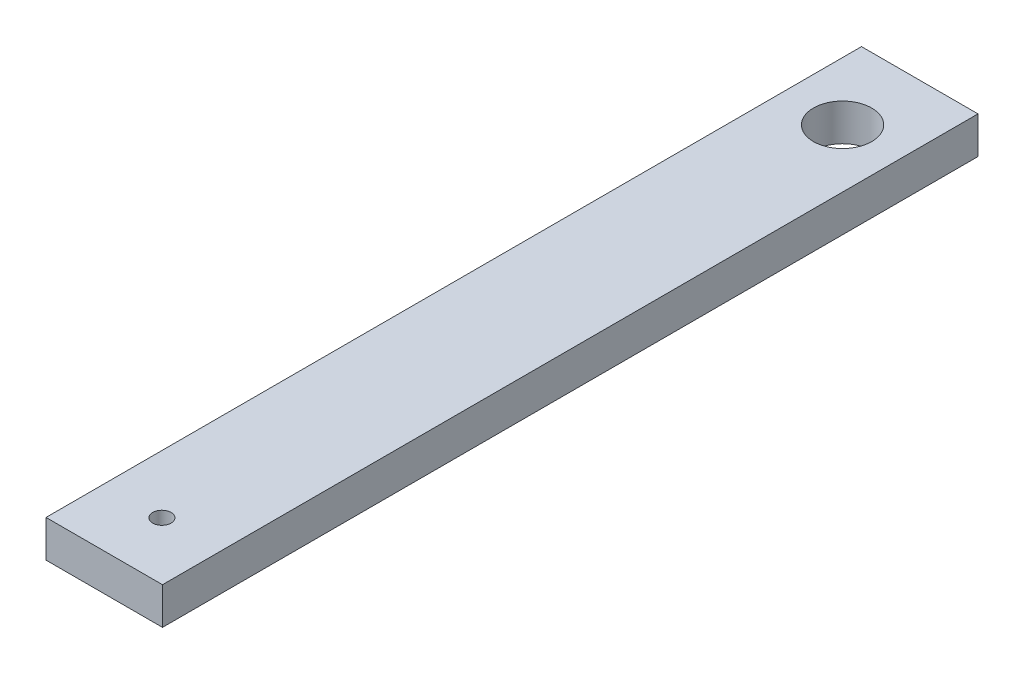
ISO-10303-21;
HEADER;
FILE_DESCRIPTION(('STEP AP214'),'2;1');
FILE_NAME('part.step','',(''),(''),'','','');
FILE_SCHEMA(('AUTOMOTIVE_DESIGN { 1 0 10303 214 1 1 1 1 }'));
ENDSEC;
DATA;
#1=APPLICATION_CONTEXT('core data for automotive mechanical design processes');
#2=APPLICATION_PROTOCOL_DEFINITION('international standard','automotive_design',2000,#1);
#3=PRODUCT_CONTEXT('',#1,'mechanical');
#4=PRODUCT('Part','Part','',(#3));
#5=PRODUCT_RELATED_PRODUCT_CATEGORY('part','',(#4));
#6=PRODUCT_DEFINITION_FORMATION('','',#4);
#7=PRODUCT_DEFINITION_CONTEXT('part definition',#1,'design');
#8=PRODUCT_DEFINITION('design','',#6,#7);
#9=PRODUCT_DEFINITION_SHAPE('','',#8);
#10=(LENGTH_UNIT() NAMED_UNIT(*) SI_UNIT(.MILLI.,.METRE.));
#11=(NAMED_UNIT(*) PLANE_ANGLE_UNIT() SI_UNIT($,.RADIAN.));
#12=(NAMED_UNIT(*) SI_UNIT($,.STERADIAN.) SOLID_ANGLE_UNIT());
#13=UNCERTAINTY_MEASURE_WITH_UNIT(LENGTH_MEASURE(1.E-05),#10,'distance_accuracy_value','');
#14=(GEOMETRIC_REPRESENTATION_CONTEXT(3) GLOBAL_UNCERTAINTY_ASSIGNED_CONTEXT((#13)) GLOBAL_UNIT_ASSIGNED_CONTEXT((#10,
#11,#12)) REPRESENTATION_CONTEXT('',''));
#15=CARTESIAN_POINT('',(0.,0.,0.));
#16=DIRECTION('',(0.,0.,1.));
#17=DIRECTION('',(1.,0.,0.));
#18=AXIS2_PLACEMENT_3D('',#15,#16,#17);
#19=CARTESIAN_POINT('',(0.,6.35,0.));
#20=DIRECTION('',(0.,-1.,0.));
#21=DIRECTION('',(0.,0.,-1.));
#22=AXIS2_PLACEMENT_3D('',#19,#20,#21);
#23=PLANE('',#22);
#24=DIRECTION('',(0.,0.,1.));
#25=VECTOR('',#24,1.);
#26=CARTESIAN_POINT('',(-9.99999999999999,6.35,63.375));
#27=LINE('',#26,#25);
#28=CARTESIAN_POINT('',(-10.,6.35,-76.625));
#29=VERTEX_POINT('',#28);
#30=CARTESIAN_POINT('',(-9.99999999999999,6.35,63.375));
#31=VERTEX_POINT('',#30);
#32=EDGE_CURVE('E96',#29,#31,#27,.T.);
#33=ORIENTED_EDGE('',*,*,#32,.T.);
#34=DIRECTION('',(1.,0.,0.));
#35=VECTOR('',#34,1.);
#36=CARTESIAN_POINT('',(-9.99999999999999,6.35,63.375));
#37=LINE('',#36,#35);
#38=CARTESIAN_POINT('',(9.99999999999999,6.35,63.375));
#39=VERTEX_POINT('',#38);
#40=EDGE_CURVE('E91',#31,#39,#37,.T.);
#41=ORIENTED_EDGE('',*,*,#40,.T.);
#42=DIRECTION('',(0.,0.,-1.));
#43=VECTOR('',#42,1.);
#44=CARTESIAN_POINT('',(9.99999999999999,6.35,63.375));
#45=LINE('',#44,#43);
#46=CARTESIAN_POINT('',(9.99999999999999,6.35,-76.625));
#47=VERTEX_POINT('',#46);
#48=EDGE_CURVE('E94',#39,#47,#45,.T.);
#49=ORIENTED_EDGE('',*,*,#48,.T.);
#50=DIRECTION('',(-1.,0.,0.));
#51=VECTOR('',#50,1.);
#52=CARTESIAN_POINT('',(-10.,6.35,-76.625));
#53=LINE('',#52,#51);
#54=EDGE_CURVE('E61',#47,#29,#53,.T.);
#55=ORIENTED_EDGE('',*,*,#54,.T.);
#56=EDGE_LOOP('',(#33,#41,#49,#55));
#57=FACE_BOUND('',#56,.T.);
#58=CARTESIAN_POINT('',(0.,6.35,-63.375));
#59=DIRECTION('',(0.,1.,0.));
#60=DIRECTION('',(0.,0.,1.));
#61=AXIS2_PLACEMENT_3D('',#58,#59,#60);
#62=CIRCLE('',#61,5.);
#63=CARTESIAN_POINT('',(0.,6.35,-58.375));
#64=VERTEX_POINT('',#63);
#65=EDGE_CURVE('E111',#64,#64,#62,.T.);
#66=ORIENTED_EDGE('',*,*,#65,.F.);
#67=EDGE_LOOP('',(#66));
#68=FACE_BOUND('',#67,.T.);
#69=CARTESIAN_POINT('',(0.,6.35,53.477664451473));
#70=DIRECTION('',(0.,1.,0.));
#71=DIRECTION('',(0.,0.,1.));
#72=AXIS2_PLACEMENT_3D('',#69,#70,#71);
#73=CIRCLE('',#72,1.5875);
#74=CARTESIAN_POINT('',(0.,6.35,55.065164451473));
#75=VERTEX_POINT('',#74);
#76=EDGE_CURVE('E126',#75,#75,#73,.T.);
#77=ORIENTED_EDGE('',*,*,#76,.F.);
#78=EDGE_LOOP('',(#77));
#79=FACE_BOUND('',#78,.T.);
#80=ADVANCED_FACE('F44',(#57,#68,#79),#23,.F.);
#81=CARTESIAN_POINT('',(0.,0.,0.));
#82=DIRECTION('',(0.,-1.,0.));
#83=DIRECTION('',(0.,0.,-1.));
#84=AXIS2_PLACEMENT_3D('',#81,#82,#83);
#85=PLANE('',#84);
#86=CARTESIAN_POINT('',(0.,0.,-63.375));
#87=DIRECTION('',(0.,1.,0.));
#88=DIRECTION('',(0.,0.,1.));
#89=AXIS2_PLACEMENT_3D('',#86,#87,#88);
#90=CIRCLE('',#89,5.);
#91=CARTESIAN_POINT('',(0.,0.,-58.375));
#92=VERTEX_POINT('',#91);
#93=EDGE_CURVE('E123',#92,#92,#90,.T.);
#94=ORIENTED_EDGE('',*,*,#93,.T.);
#95=EDGE_LOOP('',(#94));
#96=FACE_BOUND('',#95,.T.);
#97=DIRECTION('',(0.,0.,1.));
#98=VECTOR('',#97,1.);
#99=CARTESIAN_POINT('',(-9.99999999999999,0.,63.375));
#100=LINE('',#99,#98);
#101=CARTESIAN_POINT('',(-10.,0.,-76.625));
#102=VERTEX_POINT('',#101);
#103=CARTESIAN_POINT('',(-9.99999999999999,0.,63.375));
#104=VERTEX_POINT('',#103);
#105=EDGE_CURVE('E108',#102,#104,#100,.T.);
#106=ORIENTED_EDGE('',*,*,#105,.F.);
#107=DIRECTION('',(-1.,0.,0.));
#108=VECTOR('',#107,1.);
#109=CARTESIAN_POINT('',(-10.,0.,-76.625));
#110=LINE('',#109,#108);
#111=CARTESIAN_POINT('',(9.99999999999999,0.,-76.625));
#112=VERTEX_POINT('',#111);
#113=EDGE_CURVE('E84',#112,#102,#110,.T.);
#114=ORIENTED_EDGE('',*,*,#113,.F.);
#115=DIRECTION('',(0.,0.,-1.));
#116=VECTOR('',#115,1.);
#117=CARTESIAN_POINT('',(9.99999999999999,0.,63.375));
#118=LINE('',#117,#116);
#119=CARTESIAN_POINT('',(9.99999999999999,0.,63.375));
#120=VERTEX_POINT('',#119);
#121=EDGE_CURVE('E78',#120,#112,#118,.T.);
#122=ORIENTED_EDGE('',*,*,#121,.F.);
#123=DIRECTION('',(1.,0.,0.));
#124=VECTOR('',#123,1.);
#125=CARTESIAN_POINT('',(-9.99999999999999,0.,63.375));
#126=LINE('',#125,#124);
#127=EDGE_CURVE('E100',#104,#120,#126,.T.);
#128=ORIENTED_EDGE('',*,*,#127,.F.);
#129=EDGE_LOOP('',(#106,#114,#122,#128));
#130=FACE_BOUND('',#129,.T.);
#131=CARTESIAN_POINT('',(0.,0.,53.477664451473));
#132=DIRECTION('',(0.,1.,0.));
#133=DIRECTION('',(0.,0.,1.));
#134=AXIS2_PLACEMENT_3D('',#131,#132,#133);
#135=CIRCLE('',#134,1.5875);
#136=CARTESIAN_POINT('',(0.,0.,55.065164451473));
#137=VERTEX_POINT('',#136);
#138=EDGE_CURVE('E129',#137,#137,#135,.T.);
#139=ORIENTED_EDGE('',*,*,#138,.T.);
#140=EDGE_LOOP('',(#139));
#141=FACE_BOUND('',#140,.T.);
#142=ADVANCED_FACE('F119',(#96,#130,#141),#85,.T.);
#143=CARTESIAN_POINT('',(-9.99999999999999,6.35,63.375));
#144=DIRECTION('',(1.,0.,0.));
#145=DIRECTION('',(0.,0.,-1.));
#146=AXIS2_PLACEMENT_3D('',#143,#144,#145);
#147=PLANE('',#146);
#148=ORIENTED_EDGE('',*,*,#105,.T.);
#149=DIRECTION('',(0.,-1.,0.));
#150=VECTOR('',#149,1.);
#151=CARTESIAN_POINT('',(-9.99999999999999,6.35,63.375));
#152=LINE('',#151,#150);
#153=EDGE_CURVE('E13',#31,#104,#152,.T.);
#154=ORIENTED_EDGE('',*,*,#153,.F.);
#155=ORIENTED_EDGE('',*,*,#32,.F.);
#156=DIRECTION('',(0.,-1.,0.));
#157=VECTOR('',#156,1.);
#158=CARTESIAN_POINT('',(-10.,6.35,-76.625));
#159=LINE('',#158,#157);
#160=EDGE_CURVE('E104',#29,#102,#159,.T.);
#161=ORIENTED_EDGE('',*,*,#160,.T.);
#162=EDGE_LOOP('',(#148,#154,#155,#161));
#163=FACE_BOUND('',#162,.T.);
#164=ADVANCED_FACE('F46',(#163),#147,.F.);
#165=CARTESIAN_POINT('',(-9.99999999999999,6.35,63.375));
#166=DIRECTION('',(0.,0.,-1.));
#167=DIRECTION('',(-1.,0.,0.));
#168=AXIS2_PLACEMENT_3D('',#165,#166,#167);
#169=PLANE('',#168);
#170=ORIENTED_EDGE('',*,*,#127,.T.);
#171=DIRECTION('',(0.,-1.,0.));
#172=VECTOR('',#171,1.);
#173=CARTESIAN_POINT('',(9.99999999999999,6.35,63.375));
#174=LINE('',#173,#172);
#175=EDGE_CURVE('E53',#39,#120,#174,.T.);
#176=ORIENTED_EDGE('',*,*,#175,.F.);
#177=ORIENTED_EDGE('',*,*,#40,.F.);
#178=ORIENTED_EDGE('',*,*,#153,.T.);
#179=EDGE_LOOP('',(#170,#176,#177,#178));
#180=FACE_BOUND('',#179,.T.);
#181=ADVANCED_FACE('F99',(#180),#169,.F.);
#182=CARTESIAN_POINT('',(9.99999999999999,6.35,63.375));
#183=DIRECTION('',(-1.,0.,0.));
#184=DIRECTION('',(0.,0.,1.));
#185=AXIS2_PLACEMENT_3D('',#182,#183,#184);
#186=PLANE('',#185);
#187=ORIENTED_EDGE('',*,*,#121,.T.);
#188=DIRECTION('',(0.,-1.,0.));
#189=VECTOR('',#188,1.);
#190=CARTESIAN_POINT('',(9.99999999999999,6.35,-76.625));
#191=LINE('',#190,#189);
#192=EDGE_CURVE('E101',#47,#112,#191,.T.);
#193=ORIENTED_EDGE('',*,*,#192,.F.);
#194=ORIENTED_EDGE('',*,*,#48,.F.);
#195=ORIENTED_EDGE('',*,*,#175,.T.);
#196=EDGE_LOOP('',(#187,#193,#194,#195));
#197=FACE_BOUND('',#196,.T.);
#198=ADVANCED_FACE('F102',(#197),#186,.F.);
#199=CARTESIAN_POINT('',(-10.,6.35,-76.625));
#200=DIRECTION('',(0.,0.,1.));
#201=DIRECTION('',(1.,0.,0.));
#202=AXIS2_PLACEMENT_3D('',#199,#200,#201);
#203=PLANE('',#202);
#204=ORIENTED_EDGE('',*,*,#113,.T.);
#205=ORIENTED_EDGE('',*,*,#160,.F.);
#206=ORIENTED_EDGE('',*,*,#54,.F.);
#207=ORIENTED_EDGE('',*,*,#192,.T.);
#208=EDGE_LOOP('',(#204,#205,#206,#207));
#209=FACE_BOUND('',#208,.T.);
#210=ADVANCED_FACE('F116',(#209),#203,.F.);
#211=CARTESIAN_POINT('',(0.,6.35,-63.375));
#212=DIRECTION('',(0.,-1.,0.));
#213=DIRECTION('',(0.,0.,-1.));
#214=AXIS2_PLACEMENT_3D('',#211,#212,#213);
#215=CYLINDRICAL_SURFACE('',#214,5.);
#216=ORIENTED_EDGE('',*,*,#65,.T.);
#217=EDGE_LOOP('',(#216));
#218=FACE_BOUND('',#217,.T.);
#219=ORIENTED_EDGE('',*,*,#93,.F.);
#220=EDGE_LOOP('',(#219));
#221=FACE_BOUND('',#220,.T.);
#222=ADVANCED_FACE('F146',(#218,#221),#215,.F.);
#223=CARTESIAN_POINT('',(0.,6.35,53.477664451473));
#224=DIRECTION('',(0.,-1.,0.));
#225=DIRECTION('',(0.,0.,-1.));
#226=AXIS2_PLACEMENT_3D('',#223,#224,#225);
#227=CYLINDRICAL_SURFACE('',#226,1.5875);
#228=ORIENTED_EDGE('',*,*,#76,.T.);
#229=EDGE_LOOP('',(#228));
#230=FACE_BOUND('',#229,.T.);
#231=ORIENTED_EDGE('',*,*,#138,.F.);
#232=EDGE_LOOP('',(#231));
#233=FACE_BOUND('',#232,.T.);
#234=ADVANCED_FACE('F135',(#230,#233),#227,.F.);
#235=CLOSED_SHELL('',(#80,#142,#164,#181,#198,#210,#222,#234));
#236=MANIFOLD_SOLID_BREP('B2',#235);
#237=ADVANCED_BREP_SHAPE_REPRESENTATION('',(#18,#236),#14);
#238=SHAPE_DEFINITION_REPRESENTATION(#9,#237);
ENDSEC;
END-ISO-10303-21;
